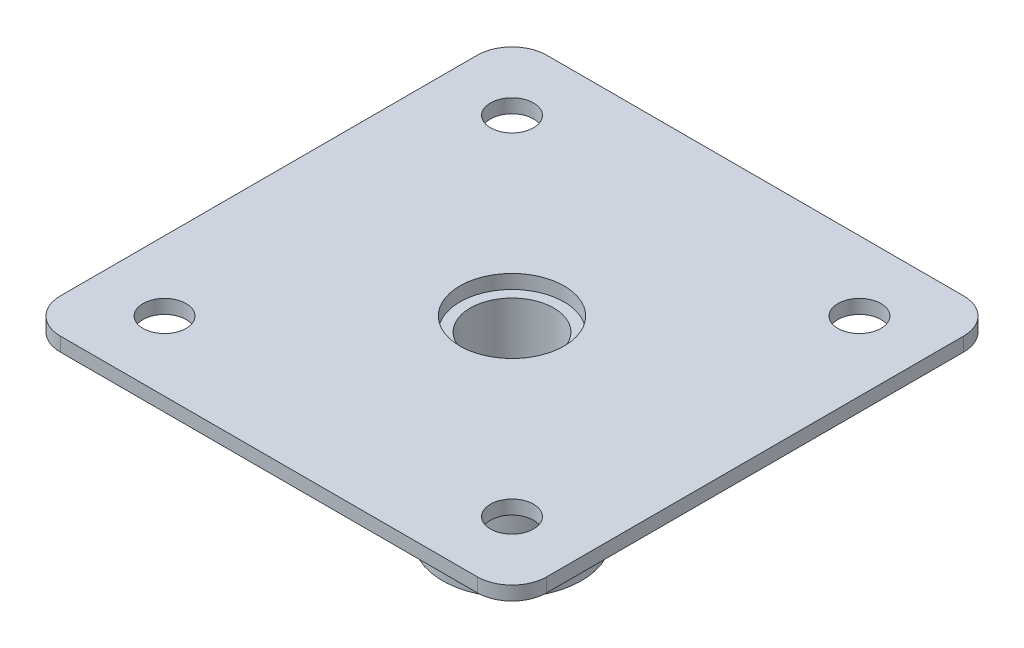
ISO-10303-21;
HEADER;
FILE_DESCRIPTION(('STEP AP214'),'2;1');
FILE_NAME('part.step','',(''),(''),'','','');
FILE_SCHEMA(('AUTOMOTIVE_DESIGN { 1 0 10303 214 1 1 1 1 }'));
ENDSEC;
DATA;
#1=APPLICATION_CONTEXT('core data for automotive mechanical design processes');
#2=APPLICATION_PROTOCOL_DEFINITION('international standard','automotive_design',2000,#1);
#3=PRODUCT_CONTEXT('',#1,'mechanical');
#4=PRODUCT('Part','Part','',(#3));
#5=PRODUCT_RELATED_PRODUCT_CATEGORY('part','',(#4));
#6=PRODUCT_DEFINITION_FORMATION('','',#4);
#7=PRODUCT_DEFINITION_CONTEXT('part definition',#1,'design');
#8=PRODUCT_DEFINITION('design','',#6,#7);
#9=PRODUCT_DEFINITION_SHAPE('','',#8);
#10=(LENGTH_UNIT() NAMED_UNIT(*) SI_UNIT(.MILLI.,.METRE.));
#11=(NAMED_UNIT(*) PLANE_ANGLE_UNIT() SI_UNIT($,.RADIAN.));
#12=(NAMED_UNIT(*) SI_UNIT($,.STERADIAN.) SOLID_ANGLE_UNIT());
#13=UNCERTAINTY_MEASURE_WITH_UNIT(LENGTH_MEASURE(1.E-05),#10,'distance_accuracy_value','');
#14=(GEOMETRIC_REPRESENTATION_CONTEXT(3) GLOBAL_UNCERTAINTY_ASSIGNED_CONTEXT((#13)) GLOBAL_UNIT_ASSIGNED_CONTEXT((#10,
#11,#12)) REPRESENTATION_CONTEXT('',''));
#15=CARTESIAN_POINT('',(0.,0.,0.));
#16=DIRECTION('',(0.,0.,1.));
#17=DIRECTION('',(1.,0.,0.));
#18=AXIS2_PLACEMENT_3D('',#15,#16,#17);
#19=CARTESIAN_POINT('',(0.,2.,0.));
#20=DIRECTION('',(0.,-1.,0.));
#21=DIRECTION('',(0.,0.,-1.));
#22=AXIS2_PLACEMENT_3D('',#19,#20,#21);
#23=CYLINDRICAL_SURFACE('',#22,6.);
#24=CARTESIAN_POINT('',(0.,-26.,0.));
#25=DIRECTION('',(0.,-1.,0.));
#26=DIRECTION('',(0.,0.,-1.));
#27=AXIS2_PLACEMENT_3D('',#24,#25,#26);
#28=CIRCLE('',#27,6.);
#29=CARTESIAN_POINT('',(0.,-26.,-6.));
#30=VERTEX_POINT('',#29);
#31=EDGE_CURVE('E207',#30,#30,#28,.T.);
#32=ORIENTED_EDGE('',*,*,#31,.T.);
#33=EDGE_LOOP('',(#32));
#34=FACE_BOUND('',#33,.T.);
#35=CARTESIAN_POINT('',(0.,0.,0.));
#36=DIRECTION('',(0.,1.,0.));
#37=DIRECTION('',(0.,0.,1.));
#38=AXIS2_PLACEMENT_3D('',#35,#36,#37);
#39=CIRCLE('',#38,6.);
#40=CARTESIAN_POINT('',(0.,0.,6.));
#41=VERTEX_POINT('',#40);
#42=EDGE_CURVE('E38',#41,#41,#39,.F.);
#43=ORIENTED_EDGE('',*,*,#42,.F.);
#44=EDGE_LOOP('',(#43));
#45=FACE_BOUND('',#44,.T.);
#46=ADVANCED_FACE('F34',(#34,#45),#23,.F.);
#47=CARTESIAN_POINT('',(0.,2.,0.));
#48=DIRECTION('',(0.,-1.,0.));
#49=DIRECTION('',(0.,0.,-1.));
#50=AXIS2_PLACEMENT_3D('',#47,#48,#49);
#51=PLANE('',#50);
#52=CARTESIAN_POINT('',(0.,2.,0.));
#53=DIRECTION('',(0.,1.,0.));
#54=DIRECTION('',(0.,0.,1.));
#55=AXIS2_PLACEMENT_3D('',#52,#53,#54);
#56=CIRCLE('',#55,7.5);
#57=CARTESIAN_POINT('',(0.,2.,7.5));
#58=VERTEX_POINT('',#57);
#59=EDGE_CURVE('E212',#58,#58,#56,.T.);
#60=ORIENTED_EDGE('',*,*,#59,.F.);
#61=EDGE_LOOP('',(#60));
#62=FACE_BOUND('',#61,.T.);
#63=DIRECTION('',(0.,0.,-1.));
#64=VECTOR('',#63,1.);
#65=CARTESIAN_POINT('',(35.,2.,35.));
#66=LINE('',#65,#64);
#67=CARTESIAN_POINT('',(35.,2.,30.));
#68=VERTEX_POINT('',#67);
#69=CARTESIAN_POINT('',(35.,2.,-30.));
#70=VERTEX_POINT('',#69);
#71=EDGE_CURVE('E139',#68,#70,#66,.T.);
#72=ORIENTED_EDGE('',*,*,#71,.T.);
#73=CARTESIAN_POINT('',(30.,2.,-30.));
#74=DIRECTION('',(0.,-1.,0.));
#75=DIRECTION('',(0.,0.,-1.));
#76=AXIS2_PLACEMENT_3D('',#73,#74,#75);
#77=CIRCLE('',#76,5.);
#78=CARTESIAN_POINT('',(30.,2.,-35.));
#79=VERTEX_POINT('',#78);
#80=EDGE_CURVE('E154',#70,#79,#77,.F.);
#81=ORIENTED_EDGE('',*,*,#80,.T.);
#82=DIRECTION('',(-1.,0.,0.));
#83=VECTOR('',#82,1.);
#84=CARTESIAN_POINT('',(-35.,2.,-35.));
#85=LINE('',#84,#83);
#86=CARTESIAN_POINT('',(-30.,2.,-35.));
#87=VERTEX_POINT('',#86);
#88=EDGE_CURVE('E121',#79,#87,#85,.T.);
#89=ORIENTED_EDGE('',*,*,#88,.T.);
#90=CARTESIAN_POINT('',(-30.,2.,-30.));
#91=DIRECTION('',(0.,-1.,0.));
#92=DIRECTION('',(0.,0.,-1.));
#93=AXIS2_PLACEMENT_3D('',#90,#91,#92);
#94=CIRCLE('',#93,5.);
#95=CARTESIAN_POINT('',(-35.,2.,-30.));
#96=VERTEX_POINT('',#95);
#97=EDGE_CURVE('E152',#87,#96,#94,.F.);
#98=ORIENTED_EDGE('',*,*,#97,.T.);
#99=DIRECTION('',(0.,0.,1.));
#100=VECTOR('',#99,1.);
#101=CARTESIAN_POINT('',(-35.,2.,35.));
#102=LINE('',#101,#100);
#103=CARTESIAN_POINT('',(-35.,2.,30.));
#104=VERTEX_POINT('',#103);
#105=EDGE_CURVE('E166',#96,#104,#102,.T.);
#106=ORIENTED_EDGE('',*,*,#105,.T.);
#107=CARTESIAN_POINT('',(-30.,2.,30.));
#108=DIRECTION('',(0.,-1.,0.));
#109=DIRECTION('',(0.,0.,-1.));
#110=AXIS2_PLACEMENT_3D('',#107,#108,#109);
#111=CIRCLE('',#110,5.);
#112=CARTESIAN_POINT('',(-30.,2.,35.));
#113=VERTEX_POINT('',#112);
#114=EDGE_CURVE('E56',#104,#113,#111,.F.);
#115=ORIENTED_EDGE('',*,*,#114,.T.);
#116=DIRECTION('',(1.,0.,0.));
#117=VECTOR('',#116,1.);
#118=CARTESIAN_POINT('',(-35.,2.,35.));
#119=LINE('',#118,#117);
#120=CARTESIAN_POINT('',(30.,2.,35.));
#121=VERTEX_POINT('',#120);
#122=EDGE_CURVE('E140',#113,#121,#119,.T.);
#123=ORIENTED_EDGE('',*,*,#122,.T.);
#124=CARTESIAN_POINT('',(30.,2.,30.));
#125=DIRECTION('',(0.,-1.,0.));
#126=DIRECTION('',(0.,0.,-1.));
#127=AXIS2_PLACEMENT_3D('',#124,#125,#126);
#128=CIRCLE('',#127,5.);
#129=EDGE_CURVE('E149',#121,#68,#128,.F.);
#130=ORIENTED_EDGE('',*,*,#129,.T.);
#131=EDGE_LOOP('',(#72,#81,#89,#98,#106,#115,#123,#130));
#132=FACE_BOUND('',#131,.T.);
#133=CARTESIAN_POINT('',(25.,2.,-25.));
#134=DIRECTION('',(0.,1.,0.));
#135=DIRECTION('',(0.,0.,1.));
#136=AXIS2_PLACEMENT_3D('',#133,#134,#135);
#137=CIRCLE('',#136,3.1);
#138=CARTESIAN_POINT('',(25.,2.,-21.9));
#139=VERTEX_POINT('',#138);
#140=EDGE_CURVE('E134',#139,#139,#137,.T.);
#141=ORIENTED_EDGE('',*,*,#140,.F.);
#142=EDGE_LOOP('',(#141));
#143=FACE_BOUND('',#142,.T.);
#144=CARTESIAN_POINT('',(-25.,2.,25.));
#145=DIRECTION('',(0.,1.,0.));
#146=DIRECTION('',(0.,0.,-1.));
#147=AXIS2_PLACEMENT_3D('',#144,#145,#146);
#148=CIRCLE('',#147,3.09999999999999);
#149=CARTESIAN_POINT('',(-25.,2.,21.9));
#150=VERTEX_POINT('',#149);
#151=EDGE_CURVE('E183',#150,#150,#148,.T.);
#152=ORIENTED_EDGE('',*,*,#151,.F.);
#153=EDGE_LOOP('',(#152));
#154=FACE_BOUND('',#153,.T.);
#155=CARTESIAN_POINT('',(-25.,2.,-25.));
#156=DIRECTION('',(0.,1.,0.));
#157=DIRECTION('',(0.,0.,1.));
#158=AXIS2_PLACEMENT_3D('',#155,#156,#157);
#159=CIRCLE('',#158,3.09999999999999);
#160=CARTESIAN_POINT('',(-25.,2.,-21.9));
#161=VERTEX_POINT('',#160);
#162=EDGE_CURVE('E189',#161,#161,#159,.T.);
#163=ORIENTED_EDGE('',*,*,#162,.F.);
#164=EDGE_LOOP('',(#163));
#165=FACE_BOUND('',#164,.T.);
#166=CARTESIAN_POINT('',(25.,2.,25.));
#167=DIRECTION('',(0.,1.,0.));
#168=DIRECTION('',(0.,0.,-1.));
#169=AXIS2_PLACEMENT_3D('',#166,#167,#168);
#170=CIRCLE('',#169,3.1);
#171=CARTESIAN_POINT('',(25.,2.,21.9));
#172=VERTEX_POINT('',#171);
#173=EDGE_CURVE('E195',#172,#172,#170,.T.);
#174=ORIENTED_EDGE('',*,*,#173,.F.);
#175=EDGE_LOOP('',(#174));
#176=FACE_BOUND('',#175,.T.);
#177=ADVANCED_FACE('F225',(#62,#132,#143,#154,#165,#176),#51,.F.);
#178=CARTESIAN_POINT('',(0.,0.,0.));
#179=DIRECTION('',(0.,-1.,0.));
#180=DIRECTION('',(0.,0.,-1.));
#181=AXIS2_PLACEMENT_3D('',#178,#179,#180);
#182=PLANE('',#181);
#183=CARTESIAN_POINT('',(0.,0.,0.));
#184=DIRECTION('',(0.,-1.,0.));
#185=DIRECTION('',(0.,0.,-1.));
#186=AXIS2_PLACEMENT_3D('',#183,#184,#185);
#187=CIRCLE('',#186,10.);
#188=CARTESIAN_POINT('',(0.,0.,-10.));
#189=VERTEX_POINT('',#188);
#190=EDGE_CURVE('E204',#189,#189,#187,.T.);
#191=ORIENTED_EDGE('',*,*,#190,.F.);
#192=EDGE_LOOP('',(#191));
#193=FACE_BOUND('',#192,.T.);
#194=CARTESIAN_POINT('',(-25.,0.,-25.));
#195=DIRECTION('',(0.,1.,0.));
#196=DIRECTION('',(0.,0.,1.));
#197=AXIS2_PLACEMENT_3D('',#194,#195,#196);
#198=CIRCLE('',#197,3.09999999999999);
#199=CARTESIAN_POINT('',(-25.,0.,-21.9));
#200=VERTEX_POINT('',#199);
#201=EDGE_CURVE('E192',#200,#200,#198,.T.);
#202=ORIENTED_EDGE('',*,*,#201,.T.);
#203=EDGE_LOOP('',(#202));
#204=FACE_BOUND('',#203,.T.);
#205=CARTESIAN_POINT('',(25.,0.,-25.));
#206=DIRECTION('',(0.,1.,0.));
#207=DIRECTION('',(0.,0.,1.));
#208=AXIS2_PLACEMENT_3D('',#205,#206,#207);
#209=CIRCLE('',#208,3.1);
#210=CARTESIAN_POINT('',(25.,0.,-21.9));
#211=VERTEX_POINT('',#210);
#212=EDGE_CURVE('E180',#211,#211,#209,.T.);
#213=ORIENTED_EDGE('',*,*,#212,.T.);
#214=EDGE_LOOP('',(#213));
#215=FACE_BOUND('',#214,.T.);
#216=DIRECTION('',(-1.,0.,0.));
#217=VECTOR('',#216,1.);
#218=CARTESIAN_POINT('',(-35.,0.,-35.));
#219=LINE('',#218,#217);
#220=CARTESIAN_POINT('',(30.,0.,-35.));
#221=VERTEX_POINT('',#220);
#222=CARTESIAN_POINT('',(-30.,0.,-35.));
#223=VERTEX_POINT('',#222);
#224=EDGE_CURVE('E118',#221,#223,#219,.T.);
#225=ORIENTED_EDGE('',*,*,#224,.F.);
#226=CARTESIAN_POINT('',(30.,0.,-30.));
#227=DIRECTION('',(0.,-1.,0.));
#228=DIRECTION('',(0.,0.,-1.));
#229=AXIS2_PLACEMENT_3D('',#226,#227,#228);
#230=CIRCLE('',#229,5.);
#231=CARTESIAN_POINT('',(35.,0.,-30.));
#232=VERTEX_POINT('',#231);
#233=EDGE_CURVE('E101',#221,#232,#230,.T.);
#234=ORIENTED_EDGE('',*,*,#233,.T.);
#235=DIRECTION('',(0.,0.,-1.));
#236=VECTOR('',#235,1.);
#237=CARTESIAN_POINT('',(35.,0.,35.));
#238=LINE('',#237,#236);
#239=CARTESIAN_POINT('',(35.,0.,30.));
#240=VERTEX_POINT('',#239);
#241=EDGE_CURVE('E129',#240,#232,#238,.T.);
#242=ORIENTED_EDGE('',*,*,#241,.F.);
#243=CARTESIAN_POINT('',(30.,0.,30.));
#244=DIRECTION('',(0.,-1.,0.));
#245=DIRECTION('',(0.,0.,-1.));
#246=AXIS2_PLACEMENT_3D('',#243,#244,#245);
#247=CIRCLE('',#246,5.);
#248=CARTESIAN_POINT('',(30.,0.,35.));
#249=VERTEX_POINT('',#248);
#250=EDGE_CURVE('E122',#240,#249,#247,.T.);
#251=ORIENTED_EDGE('',*,*,#250,.T.);
#252=DIRECTION('',(1.,0.,0.));
#253=VECTOR('',#252,1.);
#254=CARTESIAN_POINT('',(-35.,0.,35.));
#255=LINE('',#254,#253);
#256=CARTESIAN_POINT('',(-30.,0.,35.));
#257=VERTEX_POINT('',#256);
#258=EDGE_CURVE('E132',#257,#249,#255,.T.);
#259=ORIENTED_EDGE('',*,*,#258,.F.);
#260=CARTESIAN_POINT('',(-30.,0.,30.));
#261=DIRECTION('',(0.,-1.,0.));
#262=DIRECTION('',(0.,0.,-1.));
#263=AXIS2_PLACEMENT_3D('',#260,#261,#262);
#264=CIRCLE('',#263,5.);
#265=CARTESIAN_POINT('',(-35.,0.,30.));
#266=VERTEX_POINT('',#265);
#267=EDGE_CURVE('E143',#257,#266,#264,.T.);
#268=ORIENTED_EDGE('',*,*,#267,.T.);
#269=DIRECTION('',(0.,0.,1.));
#270=VECTOR('',#269,1.);
#271=CARTESIAN_POINT('',(-35.,0.,35.));
#272=LINE('',#271,#270);
#273=CARTESIAN_POINT('',(-35.,0.,-30.));
#274=VERTEX_POINT('',#273);
#275=EDGE_CURVE('E128',#274,#266,#272,.T.);
#276=ORIENTED_EDGE('',*,*,#275,.F.);
#277=CARTESIAN_POINT('',(-30.,0.,-30.));
#278=DIRECTION('',(0.,-1.,0.));
#279=DIRECTION('',(0.,0.,-1.));
#280=AXIS2_PLACEMENT_3D('',#277,#278,#279);
#281=CIRCLE('',#280,5.);
#282=EDGE_CURVE('E112',#274,#223,#281,.T.);
#283=ORIENTED_EDGE('',*,*,#282,.T.);
#284=EDGE_LOOP('',(#225,#234,#242,#251,#259,#268,#276,#283));
#285=FACE_BOUND('',#284,.T.);
#286=CARTESIAN_POINT('',(-25.,0.,25.));
#287=DIRECTION('',(0.,1.,0.));
#288=DIRECTION('',(0.,0.,-1.));
#289=AXIS2_PLACEMENT_3D('',#286,#287,#288);
#290=CIRCLE('',#289,3.09999999999999);
#291=CARTESIAN_POINT('',(-25.,0.,21.9));
#292=VERTEX_POINT('',#291);
#293=EDGE_CURVE('E186',#292,#292,#290,.T.);
#294=ORIENTED_EDGE('',*,*,#293,.T.);
#295=EDGE_LOOP('',(#294));
#296=FACE_BOUND('',#295,.T.);
#297=CARTESIAN_POINT('',(25.,0.,25.));
#298=DIRECTION('',(0.,1.,0.));
#299=DIRECTION('',(0.,0.,-1.));
#300=AXIS2_PLACEMENT_3D('',#297,#298,#299);
#301=CIRCLE('',#300,3.1);
#302=CARTESIAN_POINT('',(25.,0.,21.9));
#303=VERTEX_POINT('',#302);
#304=EDGE_CURVE('E198',#303,#303,#301,.T.);
#305=ORIENTED_EDGE('',*,*,#304,.T.);
#306=EDGE_LOOP('',(#305));
#307=FACE_BOUND('',#306,.T.);
#308=ADVANCED_FACE('F125',(#193,#204,#215,#285,#296,#307),#182,.T.);
#309=CARTESIAN_POINT('',(35.,2.,35.));
#310=DIRECTION('',(-1.,0.,0.));
#311=DIRECTION('',(0.,0.,1.));
#312=AXIS2_PLACEMENT_3D('',#309,#310,#311);
#313=PLANE('',#312);
#314=ORIENTED_EDGE('',*,*,#241,.T.);
#315=DIRECTION('',(0.,-1.,0.));
#316=VECTOR('',#315,1.);
#317=CARTESIAN_POINT('',(35.,2.,-30.));
#318=LINE('',#317,#316);
#319=EDGE_CURVE('E106',#232,#70,#318,.F.);
#320=ORIENTED_EDGE('',*,*,#319,.T.);
#321=ORIENTED_EDGE('',*,*,#71,.F.);
#322=DIRECTION('',(0.,-1.,0.));
#323=VECTOR('',#322,1.);
#324=CARTESIAN_POINT('',(35.,2.,30.));
#325=LINE('',#324,#323);
#326=EDGE_CURVE('E111',#68,#240,#325,.T.);
#327=ORIENTED_EDGE('',*,*,#326,.T.);
#328=EDGE_LOOP('',(#314,#320,#321,#327));
#329=FACE_BOUND('',#328,.T.);
#330=ADVANCED_FACE('F263',(#329),#313,.F.);
#331=CARTESIAN_POINT('',(-35.,2.,-35.));
#332=DIRECTION('',(0.,0.,1.));
#333=DIRECTION('',(1.,0.,0.));
#334=AXIS2_PLACEMENT_3D('',#331,#332,#333);
#335=PLANE('',#334);
#336=ORIENTED_EDGE('',*,*,#88,.F.);
#337=DIRECTION('',(0.,-1.,0.));
#338=VECTOR('',#337,1.);
#339=CARTESIAN_POINT('',(30.,2.,-35.));
#340=LINE('',#339,#338);
#341=EDGE_CURVE('E105',#79,#221,#340,.T.);
#342=ORIENTED_EDGE('',*,*,#341,.T.);
#343=ORIENTED_EDGE('',*,*,#224,.T.);
#344=DIRECTION('',(0.,-1.,0.));
#345=VECTOR('',#344,1.);
#346=CARTESIAN_POINT('',(-30.,2.,-35.));
#347=LINE('',#346,#345);
#348=EDGE_CURVE('E123',#223,#87,#347,.F.);
#349=ORIENTED_EDGE('',*,*,#348,.T.);
#350=EDGE_LOOP('',(#336,#342,#343,#349));
#351=FACE_BOUND('',#350,.T.);
#352=ADVANCED_FACE('F117',(#351),#335,.F.);
#353=CARTESIAN_POINT('',(-35.,2.,35.));
#354=DIRECTION('',(1.,0.,0.));
#355=DIRECTION('',(0.,0.,-1.));
#356=AXIS2_PLACEMENT_3D('',#353,#354,#355);
#357=PLANE('',#356);
#358=ORIENTED_EDGE('',*,*,#105,.F.);
#359=DIRECTION('',(0.,-1.,0.));
#360=VECTOR('',#359,1.);
#361=CARTESIAN_POINT('',(-35.,2.,-30.));
#362=LINE('',#361,#360);
#363=EDGE_CURVE('E158',#96,#274,#362,.T.);
#364=ORIENTED_EDGE('',*,*,#363,.T.);
#365=ORIENTED_EDGE('',*,*,#275,.T.);
#366=DIRECTION('',(0.,-1.,0.));
#367=VECTOR('',#366,1.);
#368=CARTESIAN_POINT('',(-35.,2.,30.));
#369=LINE('',#368,#367);
#370=EDGE_CURVE('E156',#266,#104,#369,.F.);
#371=ORIENTED_EDGE('',*,*,#370,.T.);
#372=EDGE_LOOP('',(#358,#364,#365,#371));
#373=FACE_BOUND('',#372,.T.);
#374=ADVANCED_FACE('F164',(#373),#357,.F.);
#375=CARTESIAN_POINT('',(-35.,2.,35.));
#376=DIRECTION('',(0.,0.,-1.));
#377=DIRECTION('',(-1.,0.,0.));
#378=AXIS2_PLACEMENT_3D('',#375,#376,#377);
#379=PLANE('',#378);
#380=ORIENTED_EDGE('',*,*,#122,.F.);
#381=DIRECTION('',(0.,-1.,0.));
#382=VECTOR('',#381,1.);
#383=CARTESIAN_POINT('',(-30.,2.,35.));
#384=LINE('',#383,#382);
#385=EDGE_CURVE('E12',#113,#257,#384,.T.);
#386=ORIENTED_EDGE('',*,*,#385,.T.);
#387=ORIENTED_EDGE('',*,*,#258,.T.);
#388=DIRECTION('',(0.,-1.,0.));
#389=VECTOR('',#388,1.);
#390=CARTESIAN_POINT('',(30.,2.,35.));
#391=LINE('',#390,#389);
#392=EDGE_CURVE('E43',#249,#121,#391,.F.);
#393=ORIENTED_EDGE('',*,*,#392,.T.);
#394=EDGE_LOOP('',(#380,#386,#387,#393));
#395=FACE_BOUND('',#394,.T.);
#396=ADVANCED_FACE('F173',(#395),#379,.F.);
#397=CARTESIAN_POINT('',(25.,2.,-25.));
#398=DIRECTION('',(0.,-1.,0.));
#399=DIRECTION('',(0.,0.,-1.));
#400=AXIS2_PLACEMENT_3D('',#397,#398,#399);
#401=CYLINDRICAL_SURFACE('',#400,3.1);
#402=ORIENTED_EDGE('',*,*,#140,.T.);
#403=EDGE_LOOP('',(#402));
#404=FACE_BOUND('',#403,.T.);
#405=ORIENTED_EDGE('',*,*,#212,.F.);
#406=EDGE_LOOP('',(#405));
#407=FACE_BOUND('',#406,.T.);
#408=ADVANCED_FACE('F256',(#404,#407),#401,.F.);
#409=CARTESIAN_POINT('',(-25.,2.,25.));
#410=DIRECTION('',(0.,-1.,0.));
#411=DIRECTION('',(0.,0.,-1.));
#412=AXIS2_PLACEMENT_3D('',#409,#410,#411);
#413=CYLINDRICAL_SURFACE('',#412,3.09999999999999);
#414=ORIENTED_EDGE('',*,*,#151,.T.);
#415=EDGE_LOOP('',(#414));
#416=FACE_BOUND('',#415,.T.);
#417=ORIENTED_EDGE('',*,*,#293,.F.);
#418=EDGE_LOOP('',(#417));
#419=FACE_BOUND('',#418,.T.);
#420=ADVANCED_FACE('F252',(#416,#419),#413,.F.);
#421=CARTESIAN_POINT('',(-25.,2.,-25.));
#422=DIRECTION('',(0.,-1.,0.));
#423=DIRECTION('',(0.,0.,-1.));
#424=AXIS2_PLACEMENT_3D('',#421,#422,#423);
#425=CYLINDRICAL_SURFACE('',#424,3.09999999999999);
#426=ORIENTED_EDGE('',*,*,#162,.T.);
#427=EDGE_LOOP('',(#426));
#428=FACE_BOUND('',#427,.T.);
#429=ORIENTED_EDGE('',*,*,#201,.F.);
#430=EDGE_LOOP('',(#429));
#431=FACE_BOUND('',#430,.T.);
#432=ADVANCED_FACE('F248',(#428,#431),#425,.F.);
#433=CARTESIAN_POINT('',(25.,2.,25.));
#434=DIRECTION('',(0.,-1.,0.));
#435=DIRECTION('',(0.,0.,-1.));
#436=AXIS2_PLACEMENT_3D('',#433,#434,#435);
#437=CYLINDRICAL_SURFACE('',#436,3.1);
#438=ORIENTED_EDGE('',*,*,#173,.T.);
#439=EDGE_LOOP('',(#438));
#440=FACE_BOUND('',#439,.T.);
#441=ORIENTED_EDGE('',*,*,#304,.F.);
#442=EDGE_LOOP('',(#441));
#443=FACE_BOUND('',#442,.T.);
#444=ADVANCED_FACE('F245',(#440,#443),#437,.F.);
#445=CARTESIAN_POINT('',(30.,2.,-30.));
#446=DIRECTION('',(0.,-1.,0.));
#447=DIRECTION('',(0.,0.,-1.));
#448=AXIS2_PLACEMENT_3D('',#445,#446,#447);
#449=CYLINDRICAL_SURFACE('',#448,5.);
#450=ORIENTED_EDGE('',*,*,#80,.F.);
#451=ORIENTED_EDGE('',*,*,#319,.F.);
#452=ORIENTED_EDGE('',*,*,#233,.F.);
#453=ORIENTED_EDGE('',*,*,#341,.F.);
#454=EDGE_LOOP('',(#450,#451,#452,#453));
#455=FACE_BOUND('',#454,.T.);
#456=ADVANCED_FACE('F104',(#455),#449,.T.);
#457=CARTESIAN_POINT('',(-30.,2.,-30.));
#458=DIRECTION('',(0.,-1.,0.));
#459=DIRECTION('',(0.,0.,-1.));
#460=AXIS2_PLACEMENT_3D('',#457,#458,#459);
#461=CYLINDRICAL_SURFACE('',#460,5.);
#462=ORIENTED_EDGE('',*,*,#97,.F.);
#463=ORIENTED_EDGE('',*,*,#348,.F.);
#464=ORIENTED_EDGE('',*,*,#282,.F.);
#465=ORIENTED_EDGE('',*,*,#363,.F.);
#466=EDGE_LOOP('',(#462,#463,#464,#465));
#467=FACE_BOUND('',#466,.T.);
#468=ADVANCED_FACE('F276',(#467),#461,.T.);
#469=CARTESIAN_POINT('',(-30.,2.,30.));
#470=DIRECTION('',(0.,-1.,0.));
#471=DIRECTION('',(0.,0.,-1.));
#472=AXIS2_PLACEMENT_3D('',#469,#470,#471);
#473=CYLINDRICAL_SURFACE('',#472,5.);
#474=ORIENTED_EDGE('',*,*,#114,.F.);
#475=ORIENTED_EDGE('',*,*,#370,.F.);
#476=ORIENTED_EDGE('',*,*,#267,.F.);
#477=ORIENTED_EDGE('',*,*,#385,.F.);
#478=EDGE_LOOP('',(#474,#475,#476,#477));
#479=FACE_BOUND('',#478,.T.);
#480=ADVANCED_FACE('F172',(#479),#473,.T.);
#481=CARTESIAN_POINT('',(30.,2.,30.));
#482=DIRECTION('',(0.,-1.,0.));
#483=DIRECTION('',(0.,0.,-1.));
#484=AXIS2_PLACEMENT_3D('',#481,#482,#483);
#485=CYLINDRICAL_SURFACE('',#484,5.);
#486=ORIENTED_EDGE('',*,*,#129,.F.);
#487=ORIENTED_EDGE('',*,*,#392,.F.);
#488=ORIENTED_EDGE('',*,*,#250,.F.);
#489=ORIENTED_EDGE('',*,*,#326,.F.);
#490=EDGE_LOOP('',(#486,#487,#488,#489));
#491=FACE_BOUND('',#490,.T.);
#492=ADVANCED_FACE('F36',(#491),#485,.T.);
#493=CARTESIAN_POINT('',(0.,-26.,0.));
#494=DIRECTION('',(0.,1.,0.));
#495=DIRECTION('',(0.,0.,1.));
#496=AXIS2_PLACEMENT_3D('',#493,#494,#495);
#497=CYLINDRICAL_SURFACE('',#496,10.);
#498=CARTESIAN_POINT('',(0.,-26.,0.));
#499=DIRECTION('',(0.,-1.,0.));
#500=DIRECTION('',(0.,0.,-1.));
#501=AXIS2_PLACEMENT_3D('',#498,#499,#500);
#502=CIRCLE('',#501,10.);
#503=CARTESIAN_POINT('',(0.,-26.,-10.));
#504=VERTEX_POINT('',#503);
#505=EDGE_CURVE('E201',#504,#504,#502,.T.);
#506=ORIENTED_EDGE('',*,*,#505,.F.);
#507=EDGE_LOOP('',(#506));
#508=FACE_BOUND('',#507,.T.);
#509=ORIENTED_EDGE('',*,*,#190,.T.);
#510=EDGE_LOOP('',(#509));
#511=FACE_BOUND('',#510,.T.);
#512=ADVANCED_FACE('F240',(#508,#511),#497,.T.);
#513=CARTESIAN_POINT('',(0.,-26.,0.));
#514=DIRECTION('',(0.,-1.,0.));
#515=DIRECTION('',(0.,0.,-1.));
#516=AXIS2_PLACEMENT_3D('',#513,#514,#515);
#517=PLANE('',#516);
#518=ORIENTED_EDGE('',*,*,#31,.F.);
#519=EDGE_LOOP('',(#518));
#520=FACE_BOUND('',#519,.T.);
#521=ORIENTED_EDGE('',*,*,#505,.T.);
#522=EDGE_LOOP('',(#521));
#523=FACE_BOUND('',#522,.T.);
#524=ADVANCED_FACE('F237',(#520,#523),#517,.T.);
#525=CARTESIAN_POINT('',(0.,0.,0.));
#526=DIRECTION('',(0.,1.,0.));
#527=DIRECTION('',(0.,0.,1.));
#528=AXIS2_PLACEMENT_3D('',#525,#526,#527);
#529=PLANE('',#528);
#530=CARTESIAN_POINT('',(0.,0.,0.));
#531=DIRECTION('',(0.,1.,0.));
#532=DIRECTION('',(0.,0.,1.));
#533=AXIS2_PLACEMENT_3D('',#530,#531,#532);
#534=CIRCLE('',#533,7.5);
#535=CARTESIAN_POINT('',(0.,0.,7.5));
#536=VERTEX_POINT('',#535);
#537=EDGE_CURVE('E215',#536,#536,#534,.T.);
#538=ORIENTED_EDGE('',*,*,#537,.T.);
#539=EDGE_LOOP('',(#538));
#540=FACE_BOUND('',#539,.T.);
#541=ORIENTED_EDGE('',*,*,#42,.T.);
#542=EDGE_LOOP('',(#541));
#543=FACE_BOUND('',#542,.T.);
#544=ADVANCED_FACE('F222',(#540,#543),#529,.T.);
#545=CARTESIAN_POINT('',(0.,0.,0.));
#546=DIRECTION('',(0.,1.,0.));
#547=DIRECTION('',(0.,0.,1.));
#548=AXIS2_PLACEMENT_3D('',#545,#546,#547);
#549=CYLINDRICAL_SURFACE('',#548,7.5);
#550=ORIENTED_EDGE('',*,*,#537,.F.);
#551=EDGE_LOOP('',(#550));
#552=FACE_BOUND('',#551,.T.);
#553=ORIENTED_EDGE('',*,*,#59,.T.);
#554=EDGE_LOOP('',(#553));
#555=FACE_BOUND('',#554,.T.);
#556=ADVANCED_FACE('F235',(#552,#555),#549,.F.);
#557=CLOSED_SHELL('',(#46,#177,#308,#330,#352,#374,#396,#408,#420,#432,#444,#456,#468,#480,#492,
#512,#524,#544,#556));
#558=MANIFOLD_SOLID_BREP('B2',#557);
#559=ADVANCED_BREP_SHAPE_REPRESENTATION('',(#18,#558),#14);
#560=SHAPE_DEFINITION_REPRESENTATION(#9,#559);
ENDSEC;
END-ISO-10303-21;
